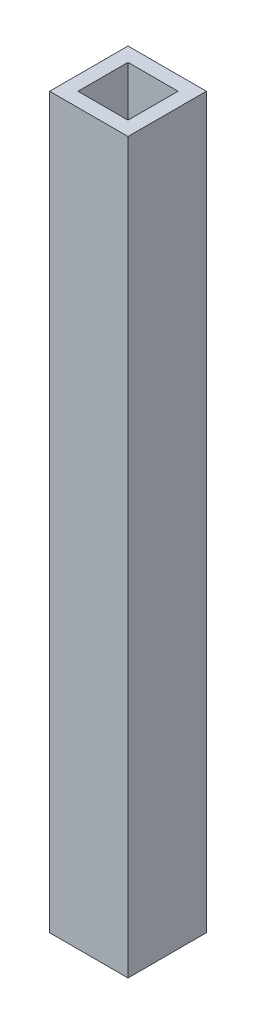
ISO-10303-21;
HEADER;
FILE_DESCRIPTION(('STEP AP214'),'2;1');
FILE_NAME('part.step','',(''),(''),'','','');
FILE_SCHEMA(('AUTOMOTIVE_DESIGN { 1 0 10303 214 1 1 1 1 }'));
ENDSEC;
DATA;
#1=APPLICATION_CONTEXT('core data for automotive mechanical design processes');
#2=APPLICATION_PROTOCOL_DEFINITION('international standard','automotive_design',2000,#1);
#3=PRODUCT_CONTEXT('',#1,'mechanical');
#4=PRODUCT('Part','Part','',(#3));
#5=PRODUCT_RELATED_PRODUCT_CATEGORY('part','',(#4));
#6=PRODUCT_DEFINITION_FORMATION('','',#4);
#7=PRODUCT_DEFINITION_CONTEXT('part definition',#1,'design');
#8=PRODUCT_DEFINITION('design','',#6,#7);
#9=PRODUCT_DEFINITION_SHAPE('','',#8);
#10=(LENGTH_UNIT() NAMED_UNIT(*) SI_UNIT(.MILLI.,.METRE.));
#11=(NAMED_UNIT(*) PLANE_ANGLE_UNIT() SI_UNIT($,.RADIAN.));
#12=(NAMED_UNIT(*) SI_UNIT($,.STERADIAN.) SOLID_ANGLE_UNIT());
#13=UNCERTAINTY_MEASURE_WITH_UNIT(LENGTH_MEASURE(1.E-05),#10,'distance_accuracy_value','');
#14=(GEOMETRIC_REPRESENTATION_CONTEXT(3) GLOBAL_UNCERTAINTY_ASSIGNED_CONTEXT((#13)) GLOBAL_UNIT_ASSIGNED_CONTEXT((#10,
#11,#12)) REPRESENTATION_CONTEXT('',''));
#15=CARTESIAN_POINT('',(0.,0.,0.));
#16=DIRECTION('',(0.,0.,1.));
#17=DIRECTION('',(1.,0.,0.));
#18=AXIS2_PLACEMENT_3D('',#15,#16,#17);
#19=CARTESIAN_POINT('',(5.969,213.106,-5.969));
#20=DIRECTION('',(-1.,0.,0.));
#21=DIRECTION('',(0.,0.,1.));
#22=AXIS2_PLACEMENT_3D('',#19,#20,#21);
#23=PLANE('',#22);
#24=DIRECTION('',(0.,0.,-1.));
#25=VECTOR('',#24,1.);
#26=CARTESIAN_POINT('',(5.969,110.998,-5.969));
#27=LINE('',#26,#25);
#28=CARTESIAN_POINT('',(5.969,110.998,5.969));
#29=VERTEX_POINT('',#28);
#30=CARTESIAN_POINT('',(5.969,110.998,-5.969));
#31=VERTEX_POINT('',#30);
#32=EDGE_CURVE('E141',#29,#31,#27,.T.);
#33=ORIENTED_EDGE('',*,*,#32,.F.);
#34=DIRECTION('',(0.,-1.,0.));
#35=VECTOR('',#34,1.);
#36=CARTESIAN_POINT('',(5.969,213.106,5.969));
#37=LINE('',#36,#35);
#38=CARTESIAN_POINT('',(5.969,0.,5.969));
#39=VERTEX_POINT('',#38);
#40=EDGE_CURVE('E155',#29,#39,#37,.T.);
#41=ORIENTED_EDGE('',*,*,#40,.T.);
#42=DIRECTION('',(0.,0.,-1.));
#43=VECTOR('',#42,1.);
#44=CARTESIAN_POINT('',(5.969,0.,-5.969));
#45=LINE('',#44,#43);
#46=CARTESIAN_POINT('',(5.969,0.,-5.969));
#47=VERTEX_POINT('',#46);
#48=EDGE_CURVE('E143',#39,#47,#45,.T.);
#49=ORIENTED_EDGE('',*,*,#48,.T.);
#50=DIRECTION('',(0.,-1.,0.));
#51=VECTOR('',#50,1.);
#52=CARTESIAN_POINT('',(5.969,213.106,-5.969));
#53=LINE('',#52,#51);
#54=EDGE_CURVE('E40',#31,#47,#53,.T.);
#55=ORIENTED_EDGE('',*,*,#54,.F.);
#56=EDGE_LOOP('',(#33,#41,#49,#55));
#57=FACE_BOUND('',#56,.T.);
#58=ADVANCED_FACE('F33',(#57),#23,.F.);
#59=CARTESIAN_POINT('',(-5.969,213.106,-5.969));
#60=DIRECTION('',(0.,0.,1.));
#61=DIRECTION('',(1.,0.,0.));
#62=AXIS2_PLACEMENT_3D('',#59,#60,#61);
#63=PLANE('',#62);
#64=DIRECTION('',(-1.,0.,0.));
#65=VECTOR('',#64,1.);
#66=CARTESIAN_POINT('',(-5.969,110.998,-5.969));
#67=LINE('',#66,#65);
#68=CARTESIAN_POINT('',(-5.969,110.998,-5.969));
#69=VERTEX_POINT('',#68);
#70=EDGE_CURVE('E139',#31,#69,#67,.T.);
#71=ORIENTED_EDGE('',*,*,#70,.F.);
#72=ORIENTED_EDGE('',*,*,#54,.T.);
#73=DIRECTION('',(-1.,0.,0.));
#74=VECTOR('',#73,1.);
#75=CARTESIAN_POINT('',(-5.969,0.,-5.969));
#76=LINE('',#75,#74);
#77=CARTESIAN_POINT('',(-5.969,0.,-5.969));
#78=VERTEX_POINT('',#77);
#79=EDGE_CURVE('E146',#47,#78,#76,.T.);
#80=ORIENTED_EDGE('',*,*,#79,.T.);
#81=DIRECTION('',(0.,-1.,0.));
#82=VECTOR('',#81,1.);
#83=CARTESIAN_POINT('',(-5.969,213.106,-5.969));
#84=LINE('',#83,#82);
#85=EDGE_CURVE('E159',#69,#78,#84,.T.);
#86=ORIENTED_EDGE('',*,*,#85,.F.);
#87=EDGE_LOOP('',(#71,#72,#80,#86));
#88=FACE_BOUND('',#87,.T.);
#89=ADVANCED_FACE('F164',(#88),#63,.F.);
#90=CARTESIAN_POINT('',(-5.969,213.106,-5.969));
#91=DIRECTION('',(1.,0.,0.));
#92=DIRECTION('',(0.,0.,-1.));
#93=AXIS2_PLACEMENT_3D('',#90,#91,#92);
#94=PLANE('',#93);
#95=DIRECTION('',(0.,0.,1.));
#96=VECTOR('',#95,1.);
#97=CARTESIAN_POINT('',(-5.969,110.998,-5.969));
#98=LINE('',#97,#96);
#99=CARTESIAN_POINT('',(-5.969,110.998,5.969));
#100=VERTEX_POINT('',#99);
#101=EDGE_CURVE('E54',#69,#100,#98,.T.);
#102=ORIENTED_EDGE('',*,*,#101,.F.);
#103=ORIENTED_EDGE('',*,*,#85,.T.);
#104=DIRECTION('',(0.,0.,1.));
#105=VECTOR('',#104,1.);
#106=CARTESIAN_POINT('',(-5.969,0.,-5.969));
#107=LINE('',#106,#105);
#108=CARTESIAN_POINT('',(-5.969,0.,5.969));
#109=VERTEX_POINT('',#108);
#110=EDGE_CURVE('E149',#78,#109,#107,.T.);
#111=ORIENTED_EDGE('',*,*,#110,.T.);
#112=DIRECTION('',(0.,-1.,0.));
#113=VECTOR('',#112,1.);
#114=CARTESIAN_POINT('',(-5.969,213.106,5.969));
#115=LINE('',#114,#113);
#116=EDGE_CURVE('E157',#100,#109,#115,.T.);
#117=ORIENTED_EDGE('',*,*,#116,.F.);
#118=EDGE_LOOP('',(#102,#103,#111,#117));
#119=FACE_BOUND('',#118,.T.);
#120=ADVANCED_FACE('F178',(#119),#94,.F.);
#121=CARTESIAN_POINT('',(-5.969,213.106,5.969));
#122=DIRECTION('',(0.,0.,-1.));
#123=DIRECTION('',(-1.,0.,0.));
#124=AXIS2_PLACEMENT_3D('',#121,#122,#123);
#125=PLANE('',#124);
#126=DIRECTION('',(1.,0.,0.));
#127=VECTOR('',#126,1.);
#128=CARTESIAN_POINT('',(-5.969,110.998,5.969));
#129=LINE('',#128,#127);
#130=EDGE_CURVE('E11',#100,#29,#129,.T.);
#131=ORIENTED_EDGE('',*,*,#130,.F.);
#132=ORIENTED_EDGE('',*,*,#116,.T.);
#133=DIRECTION('',(1.,0.,0.));
#134=VECTOR('',#133,1.);
#135=CARTESIAN_POINT('',(-5.969,0.,5.969));
#136=LINE('',#135,#134);
#137=EDGE_CURVE('E152',#109,#39,#136,.T.);
#138=ORIENTED_EDGE('',*,*,#137,.T.);
#139=ORIENTED_EDGE('',*,*,#40,.F.);
#140=EDGE_LOOP('',(#131,#132,#138,#139));
#141=FACE_BOUND('',#140,.T.);
#142=ADVANCED_FACE('F175',(#141),#125,.F.);
#143=CARTESIAN_POINT('',(0.,0.,0.));
#144=DIRECTION('',(0.,1.,0.));
#145=DIRECTION('',(0.,0.,1.));
#146=AXIS2_PLACEMENT_3D('',#143,#144,#145);
#147=PLANE('',#146);
#148=CARTESIAN_POINT('',(0.,0.,0.));
#149=DIRECTION('',(0.,-1.,0.));
#150=DIRECTION('',(0.,0.,-1.));
#151=AXIS2_PLACEMENT_3D('',#148,#149,#150);
#152=CIRCLE('',#151,4.0005);
#153=CARTESIAN_POINT('',(0.,0.,-4.0005));
#154=VERTEX_POINT('',#153);
#155=EDGE_CURVE('E122',#154,#154,#152,.T.);
#156=ORIENTED_EDGE('',*,*,#155,.F.);
#157=EDGE_LOOP('',(#156));
#158=FACE_BOUND('',#157,.T.);
#159=ORIENTED_EDGE('',*,*,#48,.F.);
#160=ORIENTED_EDGE('',*,*,#137,.F.);
#161=ORIENTED_EDGE('',*,*,#110,.F.);
#162=ORIENTED_EDGE('',*,*,#79,.F.);
#163=EDGE_LOOP('',(#159,#160,#161,#162));
#164=FACE_BOUND('',#163,.T.);
#165=ADVANCED_FACE('F171',(#158,#164),#147,.F.);
#166=CARTESIAN_POINT('',(0.,110.998,0.));
#167=DIRECTION('',(0.,1.,0.));
#168=DIRECTION('',(0.,0.,1.));
#169=AXIS2_PLACEMENT_3D('',#166,#167,#168);
#170=PLANE('',#169);
#171=DIRECTION('',(0.,0.,-1.));
#172=VECTOR('',#171,1.);
#173=CARTESIAN_POINT('',(3.81,110.998,3.81));
#174=LINE('',#173,#172);
#175=CARTESIAN_POINT('',(3.81,110.998,3.81));
#176=VERTEX_POINT('',#175);
#177=CARTESIAN_POINT('',(3.81,110.998,-3.81));
#178=VERTEX_POINT('',#177);
#179=EDGE_CURVE('E47',#176,#178,#174,.T.);
#180=ORIENTED_EDGE('',*,*,#179,.F.);
#181=DIRECTION('',(1.,0.,0.));
#182=VECTOR('',#181,1.);
#183=CARTESIAN_POINT('',(-3.81,110.998,3.81));
#184=LINE('',#183,#182);
#185=CARTESIAN_POINT('',(-3.81,110.998,3.81));
#186=VERTEX_POINT('',#185);
#187=EDGE_CURVE('E116',#186,#176,#184,.T.);
#188=ORIENTED_EDGE('',*,*,#187,.F.);
#189=DIRECTION('',(0.,0.,1.));
#190=VECTOR('',#189,1.);
#191=CARTESIAN_POINT('',(-3.81,110.998,3.81));
#192=LINE('',#191,#190);
#193=CARTESIAN_POINT('',(-3.81,110.998,-3.81));
#194=VERTEX_POINT('',#193);
#195=EDGE_CURVE('E119',#194,#186,#192,.T.);
#196=ORIENTED_EDGE('',*,*,#195,.F.);
#197=DIRECTION('',(-1.,0.,0.));
#198=VECTOR('',#197,1.);
#199=CARTESIAN_POINT('',(-3.81,110.998,-3.81));
#200=LINE('',#199,#198);
#201=EDGE_CURVE('E128',#178,#194,#200,.T.);
#202=ORIENTED_EDGE('',*,*,#201,.F.);
#203=EDGE_LOOP('',(#180,#188,#196,#202));
#204=FACE_BOUND('',#203,.T.);
#205=ORIENTED_EDGE('',*,*,#32,.T.);
#206=ORIENTED_EDGE('',*,*,#70,.T.);
#207=ORIENTED_EDGE('',*,*,#101,.T.);
#208=ORIENTED_EDGE('',*,*,#130,.T.);
#209=EDGE_LOOP('',(#205,#206,#207,#208));
#210=FACE_BOUND('',#209,.T.);
#211=ADVANCED_FACE('F210',(#204,#210),#170,.T.);
#212=CARTESIAN_POINT('',(3.81,98.298,3.81));
#213=DIRECTION('',(1.,0.,0.));
#214=DIRECTION('',(0.,0.,-1.));
#215=AXIS2_PLACEMENT_3D('',#212,#213,#214);
#216=PLANE('',#215);
#217=ORIENTED_EDGE('',*,*,#179,.T.);
#218=DIRECTION('',(0.,1.,0.));
#219=VECTOR('',#218,1.);
#220=CARTESIAN_POINT('',(3.81,98.298,-3.81));
#221=LINE('',#220,#219);
#222=CARTESIAN_POINT('',(3.81,98.298,-3.81));
#223=VERTEX_POINT('',#222);
#224=EDGE_CURVE('E94',#223,#178,#221,.T.);
#225=ORIENTED_EDGE('',*,*,#224,.F.);
#226=DIRECTION('',(0.,0.,-1.));
#227=VECTOR('',#226,1.);
#228=CARTESIAN_POINT('',(3.81,98.298,3.81));
#229=LINE('',#228,#227);
#230=CARTESIAN_POINT('',(3.81,98.298,3.81));
#231=VERTEX_POINT('',#230);
#232=EDGE_CURVE('E98',#231,#223,#229,.T.);
#233=ORIENTED_EDGE('',*,*,#232,.F.);
#234=DIRECTION('',(0.,1.,0.));
#235=VECTOR('',#234,1.);
#236=CARTESIAN_POINT('',(3.81,98.298,3.81));
#237=LINE('',#236,#235);
#238=EDGE_CURVE('E133',#231,#176,#237,.T.);
#239=ORIENTED_EDGE('',*,*,#238,.T.);
#240=EDGE_LOOP('',(#217,#225,#233,#239));
#241=FACE_BOUND('',#240,.T.);
#242=ADVANCED_FACE('F96',(#241),#216,.F.);
#243=CARTESIAN_POINT('',(-3.81,98.298,3.81));
#244=DIRECTION('',(0.,0.,1.));
#245=DIRECTION('',(1.,0.,0.));
#246=AXIS2_PLACEMENT_3D('',#243,#244,#245);
#247=PLANE('',#246);
#248=ORIENTED_EDGE('',*,*,#187,.T.);
#249=ORIENTED_EDGE('',*,*,#238,.F.);
#250=DIRECTION('',(1.,0.,0.));
#251=VECTOR('',#250,1.);
#252=CARTESIAN_POINT('',(-3.81,98.298,3.81));
#253=LINE('',#252,#251);
#254=CARTESIAN_POINT('',(-3.81,98.298,3.81));
#255=VERTEX_POINT('',#254);
#256=EDGE_CURVE('E104',#255,#231,#253,.T.);
#257=ORIENTED_EDGE('',*,*,#256,.F.);
#258=DIRECTION('',(0.,1.,0.));
#259=VECTOR('',#258,1.);
#260=CARTESIAN_POINT('',(-3.81,98.298,3.81));
#261=LINE('',#260,#259);
#262=EDGE_CURVE('E135',#255,#186,#261,.T.);
#263=ORIENTED_EDGE('',*,*,#262,.T.);
#264=EDGE_LOOP('',(#248,#249,#257,#263));
#265=FACE_BOUND('',#264,.T.);
#266=ADVANCED_FACE('F224',(#265),#247,.F.);
#267=CARTESIAN_POINT('',(-3.81,98.298,3.81));
#268=DIRECTION('',(-1.,0.,0.));
#269=DIRECTION('',(0.,0.,1.));
#270=AXIS2_PLACEMENT_3D('',#267,#268,#269);
#271=PLANE('',#270);
#272=ORIENTED_EDGE('',*,*,#195,.T.);
#273=ORIENTED_EDGE('',*,*,#262,.F.);
#274=DIRECTION('',(0.,0.,1.));
#275=VECTOR('',#274,1.);
#276=CARTESIAN_POINT('',(-3.81,98.298,3.81));
#277=LINE('',#276,#275);
#278=CARTESIAN_POINT('',(-3.81,98.298,-3.81));
#279=VERTEX_POINT('',#278);
#280=EDGE_CURVE('E112',#279,#255,#277,.T.);
#281=ORIENTED_EDGE('',*,*,#280,.F.);
#282=DIRECTION('',(0.,1.,0.));
#283=VECTOR('',#282,1.);
#284=CARTESIAN_POINT('',(-3.81,98.298,-3.81));
#285=LINE('',#284,#283);
#286=EDGE_CURVE('E103',#279,#194,#285,.T.);
#287=ORIENTED_EDGE('',*,*,#286,.T.);
#288=EDGE_LOOP('',(#272,#273,#281,#287));
#289=FACE_BOUND('',#288,.T.);
#290=ADVANCED_FACE('F233',(#289),#271,.F.);
#291=CARTESIAN_POINT('',(-3.81,98.298,-3.81));
#292=DIRECTION('',(0.,0.,-1.));
#293=DIRECTION('',(-1.,0.,0.));
#294=AXIS2_PLACEMENT_3D('',#291,#292,#293);
#295=PLANE('',#294);
#296=ORIENTED_EDGE('',*,*,#201,.T.);
#297=ORIENTED_EDGE('',*,*,#286,.F.);
#298=DIRECTION('',(-1.,0.,0.));
#299=VECTOR('',#298,1.);
#300=CARTESIAN_POINT('',(-3.81,98.298,-3.81));
#301=LINE('',#300,#299);
#302=EDGE_CURVE('E107',#223,#279,#301,.T.);
#303=ORIENTED_EDGE('',*,*,#302,.F.);
#304=ORIENTED_EDGE('',*,*,#224,.T.);
#305=EDGE_LOOP('',(#296,#297,#303,#304));
#306=FACE_BOUND('',#305,.T.);
#307=ADVANCED_FACE('F108',(#306),#295,.F.);
#308=CARTESIAN_POINT('',(0.,98.298,0.));
#309=DIRECTION('',(0.,-1.,0.));
#310=DIRECTION('',(0.,0.,-1.));
#311=AXIS2_PLACEMENT_3D('',#308,#309,#310);
#312=PLANE('',#311);
#313=ORIENTED_EDGE('',*,*,#232,.T.);
#314=ORIENTED_EDGE('',*,*,#302,.T.);
#315=ORIENTED_EDGE('',*,*,#280,.T.);
#316=ORIENTED_EDGE('',*,*,#256,.T.);
#317=EDGE_LOOP('',(#313,#314,#315,#316));
#318=FACE_BOUND('',#317,.T.);
#319=ADVANCED_FACE('F114',(#318),#312,.F.);
#320=CARTESIAN_POINT('',(0.,14.2875,0.));
#321=DIRECTION('',(0.,-1.,0.));
#322=DIRECTION('',(0.,0.,-1.));
#323=AXIS2_PLACEMENT_3D('',#320,#321,#322);
#324=CYLINDRICAL_SURFACE('',#323,4.0005);
#325=CARTESIAN_POINT('',(0.,14.2875,0.));
#326=DIRECTION('',(0.,-1.,0.));
#327=DIRECTION('',(0.,0.,-1.));
#328=AXIS2_PLACEMENT_3D('',#325,#326,#327);
#329=CIRCLE('',#328,4.0005);
#330=CARTESIAN_POINT('',(0.,14.2875,-4.0005));
#331=VERTEX_POINT('',#330);
#332=EDGE_CURVE('E129',#331,#331,#329,.T.);
#333=ORIENTED_EDGE('',*,*,#332,.F.);
#334=EDGE_LOOP('',(#333));
#335=FACE_BOUND('',#334,.T.);
#336=ORIENTED_EDGE('',*,*,#155,.T.);
#337=EDGE_LOOP('',(#336));
#338=FACE_BOUND('',#337,.T.);
#339=ADVANCED_FACE('F260',(#335,#338),#324,.F.);
#340=CARTESIAN_POINT('',(0.,14.2875,0.));
#341=DIRECTION('',(0.,-1.,0.));
#342=DIRECTION('',(0.,0.,-1.));
#343=AXIS2_PLACEMENT_3D('',#340,#341,#342);
#344=PLANE('',#343);
#345=ORIENTED_EDGE('',*,*,#332,.T.);
#346=EDGE_LOOP('',(#345));
#347=FACE_BOUND('',#346,.T.);
#348=ADVANCED_FACE('F276',(#347),#344,.T.);
#349=CLOSED_SHELL('',(#58,#89,#120,#142,#165,#211,#242,#266,#290,#307,#319,#339,#348));
#350=MANIFOLD_SOLID_BREP('B2',#349);
#351=ADVANCED_BREP_SHAPE_REPRESENTATION('',(#18,#350),#14);
#352=SHAPE_DEFINITION_REPRESENTATION(#9,#351);
ENDSEC;
END-ISO-10303-21;
